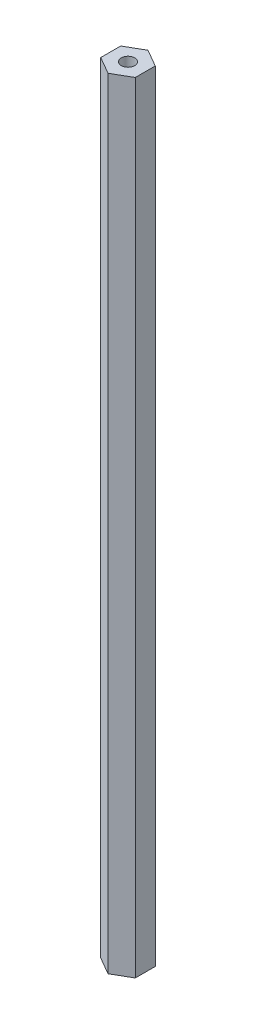
ISO-10303-21;
HEADER;
FILE_DESCRIPTION(('STEP AP214'),'2;1');
FILE_NAME('part.step','',(''),(''),'','','');
FILE_SCHEMA(('AUTOMOTIVE_DESIGN { 1 0 10303 214 1 1 1 1 }'));
ENDSEC;
DATA;
#1=APPLICATION_CONTEXT('core data for automotive mechanical design processes');
#2=APPLICATION_PROTOCOL_DEFINITION('international standard','automotive_design',2000,#1);
#3=PRODUCT_CONTEXT('',#1,'mechanical');
#4=PRODUCT('Part','Part','',(#3));
#5=PRODUCT_RELATED_PRODUCT_CATEGORY('part','',(#4));
#6=PRODUCT_DEFINITION_FORMATION('','',#4);
#7=PRODUCT_DEFINITION_CONTEXT('part definition',#1,'design');
#8=PRODUCT_DEFINITION('design','',#6,#7);
#9=PRODUCT_DEFINITION_SHAPE('','',#8);
#10=(LENGTH_UNIT() NAMED_UNIT(*) SI_UNIT(.MILLI.,.METRE.));
#11=(NAMED_UNIT(*) PLANE_ANGLE_UNIT() SI_UNIT($,.RADIAN.));
#12=(NAMED_UNIT(*) SI_UNIT($,.STERADIAN.) SOLID_ANGLE_UNIT());
#13=UNCERTAINTY_MEASURE_WITH_UNIT(LENGTH_MEASURE(1.E-05),#10,'distance_accuracy_value','');
#14=(GEOMETRIC_REPRESENTATION_CONTEXT(3) GLOBAL_UNCERTAINTY_ASSIGNED_CONTEXT((#13)) GLOBAL_UNIT_ASSIGNED_CONTEXT((#10,
#11,#12)) REPRESENTATION_CONTEXT('',''));
#15=CARTESIAN_POINT('',(0.,0.,0.));
#16=DIRECTION('',(0.,0.,1.));
#17=DIRECTION('',(1.,0.,0.));
#18=AXIS2_PLACEMENT_3D('',#15,#16,#17);
#19=CARTESIAN_POINT('',(6.34999999999995,286.639,-3.66617420935419));
#20=DIRECTION('',(-0.499999999999995,0.,0.866025403784442));
#21=DIRECTION('',(0.866025403784442,0.,0.499999999999995));
#22=AXIS2_PLACEMENT_3D('',#19,#20,#21);
#23=PLANE('',#22);
#24=DIRECTION('',(-0.866025403784442,0.,-0.499999999999995));
#25=VECTOR('',#24,1.);
#26=CARTESIAN_POINT('',(6.34999999999995,0.,-3.66617420935419));
#27=LINE('',#26,#25);
#28=CARTESIAN_POINT('',(6.34999999999995,0.,-3.66617420935419));
#29=VERTEX_POINT('',#28);
#30=CARTESIAN_POINT('',(0.,0.,-7.33234841870824));
#31=VERTEX_POINT('',#30);
#32=EDGE_CURVE('E117',#29,#31,#27,.T.);
#33=ORIENTED_EDGE('',*,*,#32,.T.);
#34=DIRECTION('',(0.,-1.,0.));
#35=VECTOR('',#34,1.);
#36=CARTESIAN_POINT('',(0.,286.639,-7.33234841870824));
#37=LINE('',#36,#35);
#38=CARTESIAN_POINT('',(0.,286.639,-7.33234841870824));
#39=VERTEX_POINT('',#38);
#40=EDGE_CURVE('E11',#39,#31,#37,.T.);
#41=ORIENTED_EDGE('',*,*,#40,.F.);
#42=DIRECTION('',(-0.866025403784442,0.,-0.499999999999995));
#43=VECTOR('',#42,1.);
#44=CARTESIAN_POINT('',(6.34999999999995,286.639,-3.66617420935419));
#45=LINE('',#44,#43);
#46=CARTESIAN_POINT('',(6.34999999999995,286.639,-3.66617420935419));
#47=VERTEX_POINT('',#46);
#48=EDGE_CURVE('E128',#47,#39,#45,.T.);
#49=ORIENTED_EDGE('',*,*,#48,.F.);
#50=DIRECTION('',(0.,-1.,0.));
#51=VECTOR('',#50,1.);
#52=CARTESIAN_POINT('',(6.34999999999995,286.639,-3.66617420935419));
#53=LINE('',#52,#51);
#54=EDGE_CURVE('E113',#47,#29,#53,.T.);
#55=ORIENTED_EDGE('',*,*,#54,.T.);
#56=EDGE_LOOP('',(#33,#41,#49,#55));
#57=FACE_BOUND('',#56,.T.);
#58=ADVANCED_FACE('F33',(#57),#23,.F.);
#59=CARTESIAN_POINT('',(0.,286.639,-7.33234841870824));
#60=DIRECTION('',(0.500000000000001,0.,0.866025403784438));
#61=DIRECTION('',(0.866025403784438,0.,-0.500000000000001));
#62=AXIS2_PLACEMENT_3D('',#59,#60,#61);
#63=PLANE('',#62);
#64=DIRECTION('',(-0.866025403784438,0.,0.500000000000001));
#65=VECTOR('',#64,1.);
#66=CARTESIAN_POINT('',(0.,0.,-7.33234841870824));
#67=LINE('',#66,#65);
#68=CARTESIAN_POINT('',(-6.35,0.,-3.6661742093541));
#69=VERTEX_POINT('',#68);
#70=EDGE_CURVE('E120',#31,#69,#67,.T.);
#71=ORIENTED_EDGE('',*,*,#70,.T.);
#72=DIRECTION('',(0.,-1.,0.));
#73=VECTOR('',#72,1.);
#74=CARTESIAN_POINT('',(-6.35,286.639,-3.6661742093541));
#75=LINE('',#74,#73);
#76=CARTESIAN_POINT('',(-6.35,286.639,-3.6661742093541));
#77=VERTEX_POINT('',#76);
#78=EDGE_CURVE('E41',#77,#69,#75,.T.);
#79=ORIENTED_EDGE('',*,*,#78,.F.);
#80=DIRECTION('',(-0.866025403784438,0.,0.500000000000001));
#81=VECTOR('',#80,1.);
#82=CARTESIAN_POINT('',(0.,286.639,-7.33234841870824));
#83=LINE('',#82,#81);
#84=EDGE_CURVE('E86',#39,#77,#83,.T.);
#85=ORIENTED_EDGE('',*,*,#84,.F.);
#86=ORIENTED_EDGE('',*,*,#40,.T.);
#87=EDGE_LOOP('',(#71,#79,#85,#86));
#88=FACE_BOUND('',#87,.T.);
#89=ADVANCED_FACE('F153',(#88),#63,.F.);
#90=CARTESIAN_POINT('',(-6.35,286.639,-3.6661742093541));
#91=DIRECTION('',(1.,0.,0.));
#92=DIRECTION('',(0.,0.,-1.));
#93=AXIS2_PLACEMENT_3D('',#90,#91,#92);
#94=PLANE('',#93);
#95=DIRECTION('',(0.,0.,1.));
#96=VECTOR('',#95,1.);
#97=CARTESIAN_POINT('',(-6.35,0.,-3.6661742093541));
#98=LINE('',#97,#96);
#99=CARTESIAN_POINT('',(-6.34999999999997,0.,3.66617420935415));
#100=VERTEX_POINT('',#99);
#101=EDGE_CURVE('E123',#69,#100,#98,.T.);
#102=ORIENTED_EDGE('',*,*,#101,.T.);
#103=DIRECTION('',(0.,-1.,0.));
#104=VECTOR('',#103,1.);
#105=CARTESIAN_POINT('',(-6.34999999999997,286.639,3.66617420935415));
#106=LINE('',#105,#104);
#107=CARTESIAN_POINT('',(-6.34999999999997,286.639,3.66617420935415));
#108=VERTEX_POINT('',#107);
#109=EDGE_CURVE('E108',#108,#100,#106,.T.);
#110=ORIENTED_EDGE('',*,*,#109,.F.);
#111=DIRECTION('',(0.,0.,1.));
#112=VECTOR('',#111,1.);
#113=CARTESIAN_POINT('',(-6.35,286.639,-3.6661742093541));
#114=LINE('',#113,#112);
#115=EDGE_CURVE('E99',#77,#108,#114,.T.);
#116=ORIENTED_EDGE('',*,*,#115,.F.);
#117=ORIENTED_EDGE('',*,*,#78,.T.);
#118=EDGE_LOOP('',(#102,#110,#116,#117));
#119=FACE_BOUND('',#118,.T.);
#120=ADVANCED_FACE('F134',(#119),#94,.F.);
#121=CARTESIAN_POINT('',(-6.34999999999997,286.639,3.66617420935415));
#122=DIRECTION('',(0.499999999999995,0.,-0.866025403784442));
#123=DIRECTION('',(-0.866025403784442,0.,-0.499999999999995));
#124=AXIS2_PLACEMENT_3D('',#121,#122,#123);
#125=PLANE('',#124);
#126=DIRECTION('',(0.866025403784442,0.,0.499999999999995));
#127=VECTOR('',#126,1.);
#128=CARTESIAN_POINT('',(-6.34999999999997,0.,3.66617420935415));
#129=LINE('',#128,#127);
#130=CARTESIAN_POINT('',(0.,0.,7.33234841870824));
#131=VERTEX_POINT('',#130);
#132=EDGE_CURVE('E107',#100,#131,#129,.T.);
#133=ORIENTED_EDGE('',*,*,#132,.T.);
#134=DIRECTION('',(0.,-1.,0.));
#135=VECTOR('',#134,1.);
#136=CARTESIAN_POINT('',(0.,286.639,7.33234841870824));
#137=LINE('',#136,#135);
#138=CARTESIAN_POINT('',(0.,286.639,7.33234841870824));
#139=VERTEX_POINT('',#138);
#140=EDGE_CURVE('E104',#139,#131,#137,.T.);
#141=ORIENTED_EDGE('',*,*,#140,.F.);
#142=DIRECTION('',(0.866025403784442,0.,0.499999999999995));
#143=VECTOR('',#142,1.);
#144=CARTESIAN_POINT('',(-6.34999999999997,286.639,3.66617420935415));
#145=LINE('',#144,#143);
#146=EDGE_CURVE('E93',#108,#139,#145,.T.);
#147=ORIENTED_EDGE('',*,*,#146,.F.);
#148=ORIENTED_EDGE('',*,*,#109,.T.);
#149=EDGE_LOOP('',(#133,#141,#147,#148));
#150=FACE_BOUND('',#149,.T.);
#151=ADVANCED_FACE('F105',(#150),#125,.F.);
#152=CARTESIAN_POINT('',(0.,286.639,7.33234841870824));
#153=DIRECTION('',(-0.500000000000007,0.,-0.866025403784434));
#154=DIRECTION('',(-0.866025403784435,0.,0.500000000000007));
#155=AXIS2_PLACEMENT_3D('',#152,#153,#154);
#156=PLANE('',#155);
#157=DIRECTION('',(0.866025403784435,0.,-0.500000000000007));
#158=VECTOR('',#157,1.);
#159=CARTESIAN_POINT('',(0.,0.,7.33234841870824));
#160=LINE('',#159,#158);
#161=CARTESIAN_POINT('',(6.35000000000002,0.,3.66617420935406));
#162=VERTEX_POINT('',#161);
#163=EDGE_CURVE('E72',#131,#162,#160,.T.);
#164=ORIENTED_EDGE('',*,*,#163,.T.);
#165=DIRECTION('',(0.,-1.,0.));
#166=VECTOR('',#165,1.);
#167=CARTESIAN_POINT('',(6.35000000000002,286.639,3.66617420935406));
#168=LINE('',#167,#166);
#169=CARTESIAN_POINT('',(6.35000000000002,286.639,3.66617420935406));
#170=VERTEX_POINT('',#169);
#171=EDGE_CURVE('E109',#170,#162,#168,.T.);
#172=ORIENTED_EDGE('',*,*,#171,.F.);
#173=DIRECTION('',(0.866025403784435,0.,-0.500000000000007));
#174=VECTOR('',#173,1.);
#175=CARTESIAN_POINT('',(0.,286.639,7.33234841870824));
#176=LINE('',#175,#174);
#177=EDGE_CURVE('E97',#139,#170,#176,.T.);
#178=ORIENTED_EDGE('',*,*,#177,.F.);
#179=ORIENTED_EDGE('',*,*,#140,.T.);
#180=EDGE_LOOP('',(#164,#172,#178,#179));
#181=FACE_BOUND('',#180,.T.);
#182=ADVANCED_FACE('F111',(#181),#156,.F.);
#183=CARTESIAN_POINT('',(6.35000000000002,286.639,3.66617420935406));
#184=DIRECTION('',(-1.,0.,0.));
#185=DIRECTION('',(0.,0.,1.));
#186=AXIS2_PLACEMENT_3D('',#183,#184,#185);
#187=PLANE('',#186);
#188=DIRECTION('',(0.,0.,-1.));
#189=VECTOR('',#188,1.);
#190=CARTESIAN_POINT('',(6.35000000000002,0.,3.66617420935406));
#191=LINE('',#190,#189);
#192=EDGE_CURVE('E78',#162,#29,#191,.T.);
#193=ORIENTED_EDGE('',*,*,#192,.T.);
#194=ORIENTED_EDGE('',*,*,#54,.F.);
#195=DIRECTION('',(0.,0.,-1.));
#196=VECTOR('',#195,1.);
#197=CARTESIAN_POINT('',(6.35000000000002,286.639,3.66617420935406));
#198=LINE('',#197,#196);
#199=EDGE_CURVE('E49',#170,#47,#198,.T.);
#200=ORIENTED_EDGE('',*,*,#199,.F.);
#201=ORIENTED_EDGE('',*,*,#171,.T.);
#202=EDGE_LOOP('',(#193,#194,#200,#201));
#203=FACE_BOUND('',#202,.T.);
#204=ADVANCED_FACE('F141',(#203),#187,.F.);
#205=CARTESIAN_POINT('',(0.,286.639,0.));
#206=DIRECTION('',(0.,1.,0.));
#207=DIRECTION('',(0.,0.,1.));
#208=AXIS2_PLACEMENT_3D('',#205,#206,#207);
#209=PLANE('',#208);
#210=CARTESIAN_POINT('',(0.,286.639,0.));
#211=DIRECTION('',(0.,1.,0.));
#212=DIRECTION('',(0.,0.,1.));
#213=AXIS2_PLACEMENT_3D('',#210,#211,#212);
#214=CIRCLE('',#213,2.4892);
#215=CARTESIAN_POINT('',(0.,286.639,2.48919999999998));
#216=VERTEX_POINT('',#215);
#217=EDGE_CURVE('E236',#216,#216,#214,.T.);
#218=ORIENTED_EDGE('',*,*,#217,.F.);
#219=EDGE_LOOP('',(#218));
#220=FACE_BOUND('',#219,.T.);
#221=ORIENTED_EDGE('',*,*,#48,.T.);
#222=ORIENTED_EDGE('',*,*,#84,.T.);
#223=ORIENTED_EDGE('',*,*,#115,.T.);
#224=ORIENTED_EDGE('',*,*,#146,.T.);
#225=ORIENTED_EDGE('',*,*,#177,.T.);
#226=ORIENTED_EDGE('',*,*,#199,.T.);
#227=EDGE_LOOP('',(#221,#222,#223,#224,#225,#226));
#228=FACE_BOUND('',#227,.T.);
#229=ADVANCED_FACE('F95',(#220,#228),#209,.T.);
#230=CARTESIAN_POINT('',(0.,0.,0.));
#231=DIRECTION('',(0.,1.,0.));
#232=DIRECTION('',(0.,0.,1.));
#233=AXIS2_PLACEMENT_3D('',#230,#231,#232);
#234=PLANE('',#233);
#235=CARTESIAN_POINT('',(0.,0.,0.));
#236=DIRECTION('',(0.,-1.,0.));
#237=DIRECTION('',(0.,0.,-1.));
#238=AXIS2_PLACEMENT_3D('',#235,#236,#237);
#239=CIRCLE('',#238,2.4892);
#240=CARTESIAN_POINT('',(0.,0.,-2.4892));
#241=VERTEX_POINT('',#240);
#242=EDGE_CURVE('E237',#241,#241,#239,.T.);
#243=ORIENTED_EDGE('',*,*,#242,.F.);
#244=EDGE_LOOP('',(#243));
#245=FACE_BOUND('',#244,.T.);
#246=ORIENTED_EDGE('',*,*,#32,.F.);
#247=ORIENTED_EDGE('',*,*,#192,.F.);
#248=ORIENTED_EDGE('',*,*,#163,.F.);
#249=ORIENTED_EDGE('',*,*,#132,.F.);
#250=ORIENTED_EDGE('',*,*,#101,.F.);
#251=ORIENTED_EDGE('',*,*,#70,.F.);
#252=EDGE_LOOP('',(#246,#247,#248,#249,#250,#251));
#253=FACE_BOUND('',#252,.T.);
#254=ADVANCED_FACE('F137',(#245,#253),#234,.F.);
#255=CARTESIAN_POINT('',(0.,261.239,0.));
#256=DIRECTION('',(0.,1.,0.));
#257=DIRECTION('',(0.,0.,1.));
#258=AXIS2_PLACEMENT_3D('',#255,#256,#257);
#259=CYLINDRICAL_SURFACE('',#258,2.4892);
#260=CARTESIAN_POINT('',(0.,261.239,0.));
#261=DIRECTION('',(0.,1.,0.));
#262=DIRECTION('',(0.,0.,1.));
#263=AXIS2_PLACEMENT_3D('',#260,#261,#262);
#264=CIRCLE('',#263,2.4892);
#265=CARTESIAN_POINT('',(0.,261.239,2.48919999999998));
#266=VERTEX_POINT('',#265);
#267=EDGE_CURVE('E121',#266,#266,#264,.T.);
#268=ORIENTED_EDGE('',*,*,#267,.F.);
#269=EDGE_LOOP('',(#268));
#270=FACE_BOUND('',#269,.T.);
#271=ORIENTED_EDGE('',*,*,#217,.T.);
#272=EDGE_LOOP('',(#271));
#273=FACE_BOUND('',#272,.T.);
#274=ADVANCED_FACE('F188',(#270,#273),#259,.F.);
#275=CARTESIAN_POINT('',(0.,261.239,0.));
#276=DIRECTION('',(0.,1.,0.));
#277=DIRECTION('',(0.,0.,1.));
#278=AXIS2_PLACEMENT_3D('',#275,#276,#277);
#279=PLANE('',#278);
#280=ORIENTED_EDGE('',*,*,#267,.T.);
#281=EDGE_LOOP('',(#280));
#282=FACE_BOUND('',#281,.T.);
#283=ADVANCED_FACE('F193',(#282),#279,.T.);
#284=CARTESIAN_POINT('',(0.,25.4,0.));
#285=DIRECTION('',(0.,-1.,0.));
#286=DIRECTION('',(0.,0.,-1.));
#287=AXIS2_PLACEMENT_3D('',#284,#285,#286);
#288=CYLINDRICAL_SURFACE('',#287,2.4892);
#289=CARTESIAN_POINT('',(0.,25.4,0.));
#290=DIRECTION('',(0.,-1.,0.));
#291=DIRECTION('',(0.,0.,-1.));
#292=AXIS2_PLACEMENT_3D('',#289,#290,#291);
#293=CIRCLE('',#292,2.4892);
#294=CARTESIAN_POINT('',(0.,25.4,-2.4892));
#295=VERTEX_POINT('',#294);
#296=EDGE_CURVE('E235',#295,#295,#293,.T.);
#297=ORIENTED_EDGE('',*,*,#296,.F.);
#298=EDGE_LOOP('',(#297));
#299=FACE_BOUND('',#298,.T.);
#300=ORIENTED_EDGE('',*,*,#242,.T.);
#301=EDGE_LOOP('',(#300));
#302=FACE_BOUND('',#301,.T.);
#303=ADVANCED_FACE('F203',(#299,#302),#288,.F.);
#304=CARTESIAN_POINT('',(0.,25.4,0.));
#305=DIRECTION('',(0.,-1.,0.));
#306=DIRECTION('',(0.,0.,-1.));
#307=AXIS2_PLACEMENT_3D('',#304,#305,#306);
#308=PLANE('',#307);
#309=ORIENTED_EDGE('',*,*,#296,.T.);
#310=EDGE_LOOP('',(#309));
#311=FACE_BOUND('',#310,.T.);
#312=ADVANCED_FACE('F219',(#311),#308,.T.);
#313=CLOSED_SHELL('',(#58,#89,#120,#151,#182,#204,#229,#254,#274,#283,#303,#312));
#314=MANIFOLD_SOLID_BREP('B2',#313);
#315=ADVANCED_BREP_SHAPE_REPRESENTATION('',(#18,#314),#14);
#316=SHAPE_DEFINITION_REPRESENTATION(#9,#315);
ENDSEC;
END-ISO-10303-21;
